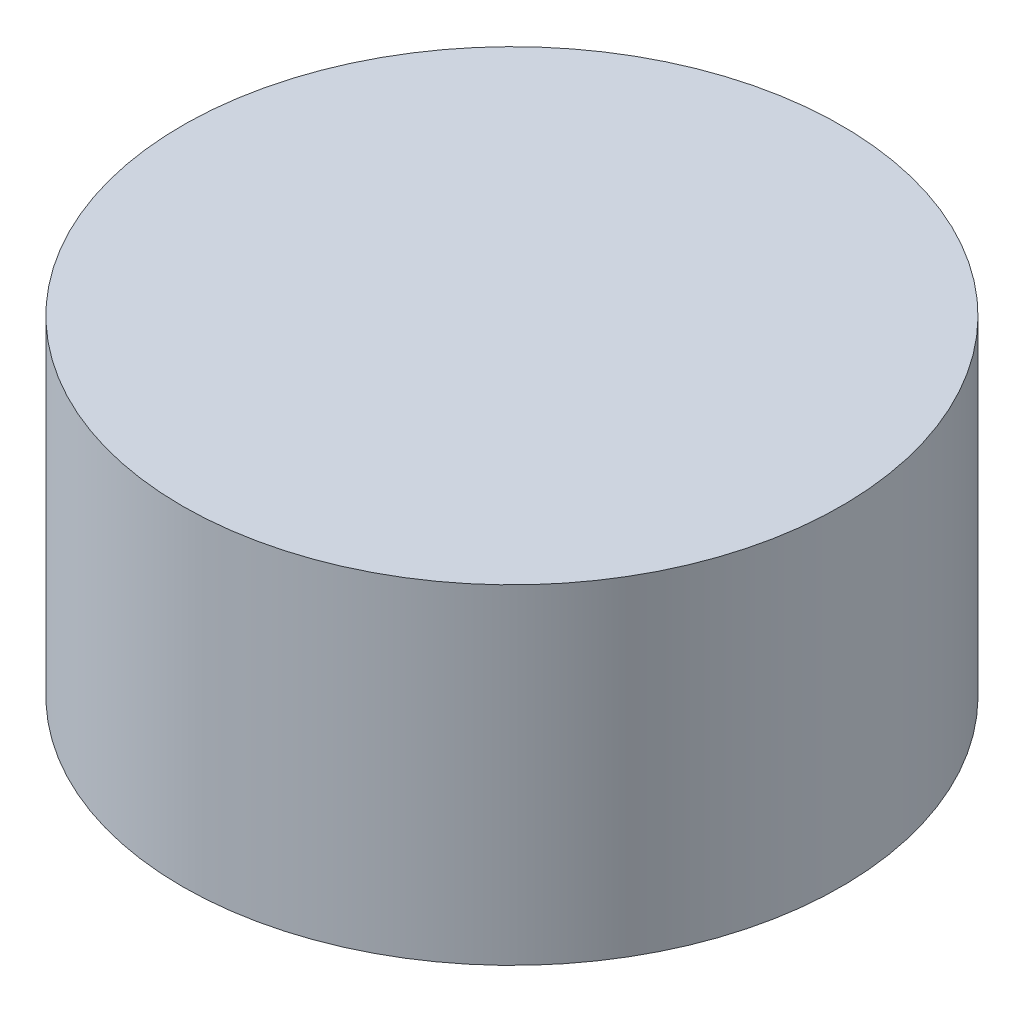
ISO-10303-21;
HEADER;
FILE_DESCRIPTION(('STEP AP214'),'2;1');
FILE_NAME('part.step','',(''),(''),'','','');
FILE_SCHEMA(('AUTOMOTIVE_DESIGN { 1 0 10303 214 1 1 1 1 }'));
ENDSEC;
DATA;
#1=APPLICATION_CONTEXT('core data for automotive mechanical design processes');
#2=APPLICATION_PROTOCOL_DEFINITION('international standard','automotive_design',2000,#1);
#3=PRODUCT_CONTEXT('',#1,'mechanical');
#4=PRODUCT('Part','Part','',(#3));
#5=PRODUCT_RELATED_PRODUCT_CATEGORY('part','',(#4));
#6=PRODUCT_DEFINITION_FORMATION('','',#4);
#7=PRODUCT_DEFINITION_CONTEXT('part definition',#1,'design');
#8=PRODUCT_DEFINITION('design','',#6,#7);
#9=PRODUCT_DEFINITION_SHAPE('','',#8);
#10=(LENGTH_UNIT() NAMED_UNIT(*) SI_UNIT(.MILLI.,.METRE.));
#11=(NAMED_UNIT(*) PLANE_ANGLE_UNIT() SI_UNIT($,.RADIAN.));
#12=(NAMED_UNIT(*) SI_UNIT($,.STERADIAN.) SOLID_ANGLE_UNIT());
#13=UNCERTAINTY_MEASURE_WITH_UNIT(LENGTH_MEASURE(1.E-05),#10,'distance_accuracy_value','');
#14=(GEOMETRIC_REPRESENTATION_CONTEXT(3) GLOBAL_UNCERTAINTY_ASSIGNED_CONTEXT((#13)) GLOBAL_UNIT_ASSIGNED_CONTEXT((#10,
#11,#12)) REPRESENTATION_CONTEXT('',''));
#15=CARTESIAN_POINT('',(0.,0.,0.));
#16=DIRECTION('',(0.,0.,1.));
#17=DIRECTION('',(1.,0.,0.));
#18=AXIS2_PLACEMENT_3D('',#15,#16,#17);
#19=CARTESIAN_POINT('',(0.,10.,0.));
#20=DIRECTION('',(0.,-1.,0.));
#21=DIRECTION('',(0.,0.,-1.));
#22=AXIS2_PLACEMENT_3D('',#19,#20,#21);
#23=CYLINDRICAL_SURFACE('',#22,10.);
#24=CARTESIAN_POINT('',(0.,10.,0.));
#25=DIRECTION('',(0.,1.,0.));
#26=DIRECTION('',(0.,0.,1.));
#27=AXIS2_PLACEMENT_3D('',#24,#25,#26);
#28=CIRCLE('',#27,10.);
#29=CARTESIAN_POINT('',(0.,10.,10.));
#30=VERTEX_POINT('',#29);
#31=EDGE_CURVE('E10',#30,#30,#28,.T.);
#32=ORIENTED_EDGE('',*,*,#31,.F.);
#33=EDGE_LOOP('',(#32));
#34=FACE_BOUND('',#33,.T.);
#35=CARTESIAN_POINT('',(0.,0.,0.));
#36=DIRECTION('',(0.,1.,0.));
#37=DIRECTION('',(0.,0.,1.));
#38=AXIS2_PLACEMENT_3D('',#35,#36,#37);
#39=CIRCLE('',#38,10.);
#40=CARTESIAN_POINT('',(0.,0.,10.));
#41=VERTEX_POINT('',#40);
#42=EDGE_CURVE('E46',#41,#41,#39,.T.);
#43=ORIENTED_EDGE('',*,*,#42,.T.);
#44=EDGE_LOOP('',(#43));
#45=FACE_BOUND('',#44,.T.);
#46=ADVANCED_FACE('F43',(#34,#45),#23,.T.);
#47=CARTESIAN_POINT('',(0.,10.,0.));
#48=DIRECTION('',(0.,1.,0.));
#49=DIRECTION('',(0.,0.,1.));
#50=AXIS2_PLACEMENT_3D('',#47,#48,#49);
#51=PLANE('',#50);
#52=ORIENTED_EDGE('',*,*,#31,.T.);
#53=EDGE_LOOP('',(#52));
#54=FACE_BOUND('',#53,.T.);
#55=ADVANCED_FACE('F60',(#54),#51,.T.);
#56=CARTESIAN_POINT('',(0.,0.,0.));
#57=DIRECTION('',(0.,1.,0.));
#58=DIRECTION('',(0.,0.,1.));
#59=AXIS2_PLACEMENT_3D('',#56,#57,#58);
#60=PLANE('',#59);
#61=ORIENTED_EDGE('',*,*,#42,.F.);
#62=EDGE_LOOP('',(#61));
#63=FACE_BOUND('',#62,.T.);
#64=ADVANCED_FACE('F58',(#63),#60,.F.);
#65=CLOSED_SHELL('',(#46,#55,#64));
#66=MANIFOLD_SOLID_BREP('B2',#65);
#67=ADVANCED_BREP_SHAPE_REPRESENTATION('',(#18,#66),#14);
#68=SHAPE_DEFINITION_REPRESENTATION(#9,#67);
ENDSEC;
END-ISO-10303-21;
